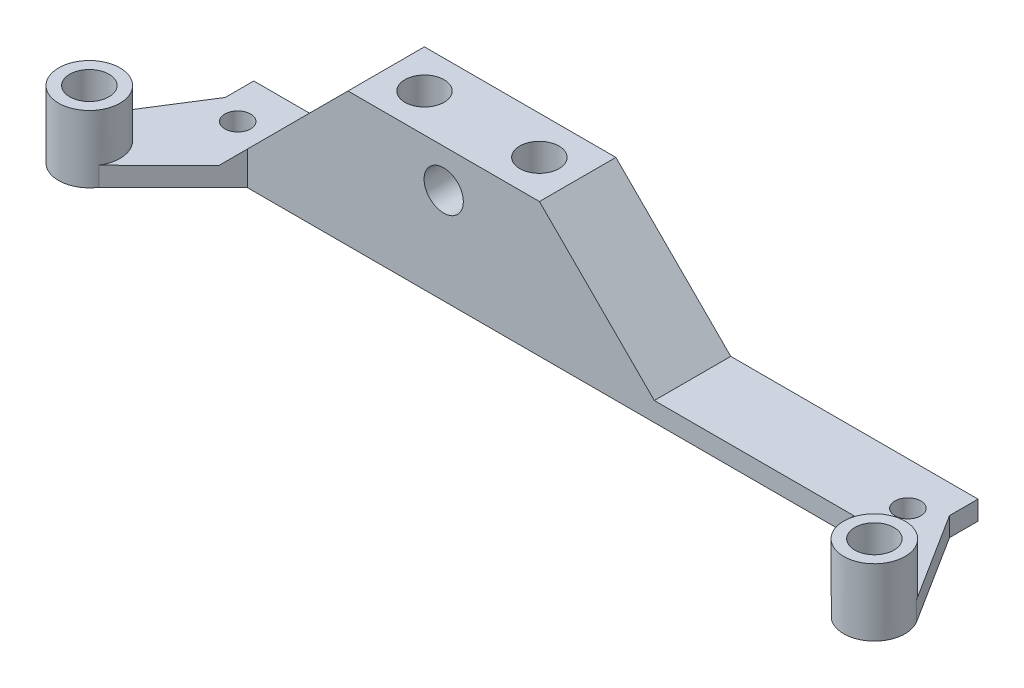
ISO-10303-21;
HEADER;
FILE_DESCRIPTION(('STEP AP214'),'2;1');
FILE_NAME('part.step','',(''),(''),'','','');
FILE_SCHEMA(('AUTOMOTIVE_DESIGN { 1 0 10303 214 1 1 1 1 }'));
ENDSEC;
DATA;
#1=APPLICATION_CONTEXT('core data for automotive mechanical design processes');
#2=APPLICATION_PROTOCOL_DEFINITION('international standard','automotive_design',2000,#1);
#3=PRODUCT_CONTEXT('',#1,'mechanical');
#4=PRODUCT('Part','Part','',(#3));
#5=PRODUCT_RELATED_PRODUCT_CATEGORY('part','',(#4));
#6=PRODUCT_DEFINITION_FORMATION('','',#4);
#7=PRODUCT_DEFINITION_CONTEXT('part definition',#1,'design');
#8=PRODUCT_DEFINITION('design','',#6,#7);
#9=PRODUCT_DEFINITION_SHAPE('','',#8);
#10=(LENGTH_UNIT() NAMED_UNIT(*) SI_UNIT(.MILLI.,.METRE.));
#11=(NAMED_UNIT(*) PLANE_ANGLE_UNIT() SI_UNIT($,.RADIAN.));
#12=(NAMED_UNIT(*) SI_UNIT($,.STERADIAN.) SOLID_ANGLE_UNIT());
#13=UNCERTAINTY_MEASURE_WITH_UNIT(LENGTH_MEASURE(1.E-05),#10,'distance_accuracy_value','');
#14=(GEOMETRIC_REPRESENTATION_CONTEXT(3) GLOBAL_UNCERTAINTY_ASSIGNED_CONTEXT((#13)) GLOBAL_UNIT_ASSIGNED_CONTEXT((#10,
#11,#12)) REPRESENTATION_CONTEXT('',''));
#15=CARTESIAN_POINT('',(0.,0.,0.));
#16=DIRECTION('',(0.,0.,1.));
#17=DIRECTION('',(1.,0.,0.));
#18=AXIS2_PLACEMENT_3D('',#15,#16,#17);
#19=CARTESIAN_POINT('',(50.2954250844381,2.,-24.539505555981));
#20=DIRECTION('',(0.,-1.,0.));
#21=DIRECTION('',(0.,0.,-1.));
#22=AXIS2_PLACEMENT_3D('',#19,#20,#21);
#23=PLANE('',#22);
#24=CARTESIAN_POINT('',(44.2954250844381,2.,-34.0395055559811));
#25=DIRECTION('',(0.,1.,0.));
#26=DIRECTION('',(0.,0.,1.));
#27=AXIS2_PLACEMENT_3D('',#24,#25,#26);
#28=CIRCLE('',#27,1.35);
#29=CARTESIAN_POINT('',(44.2954250844381,2.,-32.6895055559811));
#30=VERTEX_POINT('',#29);
#31=EDGE_CURVE('E225',#30,#30,#28,.T.);
#32=ORIENTED_EDGE('',*,*,#31,.F.);
#33=EDGE_LOOP('',(#32));
#34=FACE_BOUND('',#33,.T.);
#35=DIRECTION('',(-1.,0.,0.));
#36=VECTOR('',#35,1.);
#37=CARTESIAN_POINT('',(-28.5276596570278,2.,-38.5395055559811));
#38=LINE('',#37,#36);
#39=CARTESIAN_POINT('',(47.1182480924058,2.,-38.5395055559811));
#40=VERTEX_POINT('',#39);
#41=CARTESIAN_POINT('',(21.2954250843891,2.,-38.5395055559811));
#42=VERTEX_POINT('',#41);
#43=EDGE_CURVE('E231',#40,#42,#38,.T.);
#44=ORIENTED_EDGE('',*,*,#43,.T.);
#45=DIRECTION('',(0.,0.,1.));
#46=VECTOR('',#45,1.);
#47=CARTESIAN_POINT('',(21.2954250843891,2.,-30.5548807448663));
#48=LINE('',#47,#46);
#49=CARTESIAN_POINT('',(21.2954250843891,2.,-30.5548807448663));
#50=VERTEX_POINT('',#49);
#51=EDGE_CURVE('E150',#42,#50,#48,.T.);
#52=ORIENTED_EDGE('',*,*,#51,.T.);
#53=DIRECTION('',(1.,0.,0.));
#54=VECTOR('',#53,1.);
#55=CARTESIAN_POINT('',(-21.197718512781,2.,-30.5548807448663));
#56=LINE('',#55,#54);
#57=CARTESIAN_POINT('',(42.1517451114346,2.,-30.5548807448663));
#58=VERTEX_POINT('',#57);
#59=EDGE_CURVE('E183',#50,#58,#56,.T.);
#60=ORIENTED_EDGE('',*,*,#59,.T.);
#61=DIRECTION('',(0.,0.,1.));
#62=VECTOR('',#61,1.);
#63=CARTESIAN_POINT('',(42.1517451114346,2.,-29.1982208758625));
#64=LINE('',#63,#62);
#65=CARTESIAN_POINT('',(42.1517451114346,2.,-29.1982208758625));
#66=VERTEX_POINT('',#65);
#67=EDGE_CURVE('E240',#58,#66,#64,.T.);
#68=ORIENTED_EDGE('',*,*,#67,.T.);
#69=DIRECTION('',(0.65088317788447,0.,0.759177903226256));
#70=VECTOR('',#69,1.);
#71=CARTESIAN_POINT('',(42.1517451114346,2.,-29.1982208758625));
#72=LINE('',#71,#70);
#73=CARTESIAN_POINT('',(47.5379021217262,2.,-22.9159085893305));
#74=VERTEX_POINT('',#73);
#75=EDGE_CURVE('E242',#66,#74,#72,.T.);
#76=ORIENTED_EDGE('',*,*,#75,.T.);
#77=CARTESIAN_POINT('',(50.2954250844381,2.,-24.539505555981));
#78=DIRECTION('',(0.,1.,0.));
#79=DIRECTION('',(0.,0.,1.));
#80=AXIS2_PLACEMENT_3D('',#77,#78,#79);
#81=CIRCLE('',#80,3.20000000000002);
#82=CARTESIAN_POINT('',(53.0009895741372,2.,-26.2482831284226));
#83=VERTEX_POINT('',#82);
#84=EDGE_CURVE('E198',#83,#74,#81,.T.);
#85=ORIENTED_EDGE('',*,*,#84,.F.);
#86=DIRECTION('',(-0.53399299138798,0.,-0.845488903030973));
#87=VECTOR('',#86,1.);
#88=CARTESIAN_POINT('',(53.0009895741372,2.,-26.2482831284226));
#89=LINE('',#88,#87);
#90=CARTESIAN_POINT('',(47.1182480924058,2.,-35.5626238078308));
#91=VERTEX_POINT('',#90);
#92=EDGE_CURVE('E245',#83,#91,#89,.T.);
#93=ORIENTED_EDGE('',*,*,#92,.T.);
#94=DIRECTION('',(0.,0.,-1.));
#95=VECTOR('',#94,1.);
#96=CARTESIAN_POINT('',(47.1182480924058,2.,-38.5395055559811));
#97=LINE('',#96,#95);
#98=EDGE_CURVE('E247',#91,#40,#97,.T.);
#99=ORIENTED_EDGE('',*,*,#98,.T.);
#100=EDGE_LOOP('',(#44,#52,#60,#68,#76,#85,#93,#99));
#101=FACE_BOUND('',#100,.T.);
#102=ADVANCED_FACE('F35',(#34,#101),#23,.F.);
#103=CARTESIAN_POINT('',(-25.7045749155619,2.,-34.0395055559811));
#104=DIRECTION('',(0.,1.,0.));
#105=DIRECTION('',(0.,0.,1.));
#106=AXIS2_PLACEMENT_3D('',#103,#104,#105);
#107=CIRCLE('',#106,1.35);
#108=CARTESIAN_POINT('',(-25.7045749155619,2.,-32.6895055559811));
#109=VERTEX_POINT('',#108);
#110=EDGE_CURVE('E216',#109,#109,#107,.T.);
#111=ORIENTED_EDGE('',*,*,#110,.F.);
#112=EDGE_LOOP('',(#111));
#113=FACE_BOUND('',#112,.T.);
#114=DIRECTION('',(0.710611314616584,0.,-0.703584792003701));
#115=VECTOR('',#114,1.);
#116=CARTESIAN_POINT('',(-28.9990104258628,2.,-22.8307279835395));
#117=LINE('',#116,#115);
#118=CARTESIAN_POINT('',(-28.9990104258628,2.,-22.8307279835395));
#119=VERTEX_POINT('',#118);
#120=CARTESIAN_POINT('',(-22.7045749156108,2.,-29.0629241337666));
#121=VERTEX_POINT('',#120);
#122=EDGE_CURVE('E238',#119,#121,#117,.T.);
#123=ORIENTED_EDGE('',*,*,#122,.T.);
#124=DIRECTION('',(0.,0.,-1.));
#125=VECTOR('',#124,1.);
#126=CARTESIAN_POINT('',(-22.7045749156108,2.,-38.5395055559811));
#127=LINE('',#126,#125);
#128=CARTESIAN_POINT('',(-22.7045749156108,2.,-38.5395055559811));
#129=VERTEX_POINT('',#128);
#130=EDGE_CURVE('E155',#121,#129,#127,.T.);
#131=ORIENTED_EDGE('',*,*,#130,.T.);
#132=CARTESIAN_POINT('',(-28.5276596570278,2.,-38.5395055559811));
#133=VERTEX_POINT('',#132);
#134=EDGE_CURVE('E234',#129,#133,#38,.T.);
#135=ORIENTED_EDGE('',*,*,#134,.T.);
#136=DIRECTION('',(0.,0.,1.));
#137=VECTOR('',#136,1.);
#138=CARTESIAN_POINT('',(-28.5276596570278,2.,-38.5395055559811));
#139=LINE('',#138,#137);
#140=CARTESIAN_POINT('',(-28.5276596570278,2.,-35.5627891080539));
#141=VERTEX_POINT('',#140);
#142=EDGE_CURVE('E233',#133,#141,#139,.T.);
#143=ORIENTED_EDGE('',*,*,#142,.T.);
#144=DIRECTION('',(-0.533969233102133,0.,0.84550390779719));
#145=VECTOR('',#144,1.);
#146=CARTESIAN_POINT('',(-34.410139405261,2.,-26.2482831284225));
#147=LINE('',#146,#145);
#148=CARTESIAN_POINT('',(-34.410139405261,2.,-26.2482831284225));
#149=VERTEX_POINT('',#148);
#150=EDGE_CURVE('E236',#141,#149,#147,.T.);
#151=ORIENTED_EDGE('',*,*,#150,.T.);
#152=CARTESIAN_POINT('',(-31.7045749155619,2.,-24.539505555981));
#153=DIRECTION('',(0.,1.,0.));
#154=DIRECTION('',(0.,0.,1.));
#155=AXIS2_PLACEMENT_3D('',#152,#153,#154);
#156=CIRCLE('',#155,3.2);
#157=EDGE_CURVE('E206',#119,#149,#156,.T.);
#158=ORIENTED_EDGE('',*,*,#157,.F.);
#159=EDGE_LOOP('',(#123,#131,#135,#143,#151,#158));
#160=FACE_BOUND('',#159,.T.);
#161=ADVANCED_FACE('F309',(#113,#160),#23,.F.);
#162=CARTESIAN_POINT('',(50.2954250844381,0.,-24.539505555981));
#163=DIRECTION('',(0.,-1.,0.));
#164=DIRECTION('',(0.,0.,-1.));
#165=AXIS2_PLACEMENT_3D('',#162,#163,#164);
#166=PLANE('',#165);
#167=DIRECTION('',(0.,0.,1.));
#168=VECTOR('',#167,1.);
#169=CARTESIAN_POINT('',(-28.5276596570278,0.,-38.5395055559811));
#170=LINE('',#169,#168);
#171=CARTESIAN_POINT('',(-28.5276596570278,0.,-38.5395055559811));
#172=VERTEX_POINT('',#171);
#173=CARTESIAN_POINT('',(-28.5276596570278,0.,-35.5627891080539));
#174=VERTEX_POINT('',#173);
#175=EDGE_CURVE('E251',#172,#174,#170,.T.);
#176=ORIENTED_EDGE('',*,*,#175,.F.);
#177=DIRECTION('',(-1.,0.,0.));
#178=VECTOR('',#177,1.);
#179=CARTESIAN_POINT('',(-28.5276596570278,0.,-38.5395055559811));
#180=LINE('',#179,#178);
#181=CARTESIAN_POINT('',(47.1182480924058,0.,-38.5395055559811));
#182=VERTEX_POINT('',#181);
#183=EDGE_CURVE('E228',#182,#172,#180,.T.);
#184=ORIENTED_EDGE('',*,*,#183,.F.);
#185=DIRECTION('',(0.,0.,-1.));
#186=VECTOR('',#185,1.);
#187=CARTESIAN_POINT('',(47.1182480924058,0.,-38.5395055559811));
#188=LINE('',#187,#186);
#189=CARTESIAN_POINT('',(47.1182480924058,0.,-35.5626238078308));
#190=VERTEX_POINT('',#189);
#191=EDGE_CURVE('E267',#190,#182,#188,.T.);
#192=ORIENTED_EDGE('',*,*,#191,.F.);
#193=DIRECTION('',(-0.53399299138798,0.,-0.845488903030973));
#194=VECTOR('',#193,1.);
#195=CARTESIAN_POINT('',(53.0009895741372,0.,-26.2482831284226));
#196=LINE('',#195,#194);
#197=CARTESIAN_POINT('',(53.0009895741372,0.,-26.2482831284226));
#198=VERTEX_POINT('',#197);
#199=EDGE_CURVE('E265',#198,#190,#196,.T.);
#200=ORIENTED_EDGE('',*,*,#199,.F.);
#201=CARTESIAN_POINT('',(50.2954250844381,0.,-24.539505555981));
#202=DIRECTION('',(0.,1.,0.));
#203=DIRECTION('',(0.,0.,-1.));
#204=AXIS2_PLACEMENT_3D('',#201,#202,#203);
#205=CIRCLE('',#204,3.2);
#206=CARTESIAN_POINT('',(48.2697894922181,0.,-22.0622489185833));
#207=VERTEX_POINT('',#206);
#208=EDGE_CURVE('E263',#207,#198,#205,.T.);
#209=ORIENTED_EDGE('',*,*,#208,.F.);
#210=DIRECTION('',(0.65088317788447,0.,0.759177903226256));
#211=VECTOR('',#210,1.);
#212=CARTESIAN_POINT('',(42.1517451114346,0.,-29.1982208758625));
#213=LINE('',#212,#211);
#214=CARTESIAN_POINT('',(42.1517451114346,0.,-29.1982208758625));
#215=VERTEX_POINT('',#214);
#216=EDGE_CURVE('E261',#215,#207,#213,.T.);
#217=ORIENTED_EDGE('',*,*,#216,.F.);
#218=DIRECTION('',(0.,0.,1.));
#219=VECTOR('',#218,1.);
#220=CARTESIAN_POINT('',(42.1517451114346,0.,-29.1982208758625));
#221=LINE('',#220,#219);
#222=CARTESIAN_POINT('',(42.1517451114346,0.,-30.5548807448663));
#223=VERTEX_POINT('',#222);
#224=EDGE_CURVE('E259',#223,#215,#221,.T.);
#225=ORIENTED_EDGE('',*,*,#224,.F.);
#226=DIRECTION('',(1.,0.,0.));
#227=VECTOR('',#226,1.);
#228=CARTESIAN_POINT('',(-21.197718512781,0.,-30.5548807448663));
#229=LINE('',#228,#227);
#230=CARTESIAN_POINT('',(-21.197718512781,0.,-30.5548807448663));
#231=VERTEX_POINT('',#230);
#232=EDGE_CURVE('E185',#231,#223,#229,.T.);
#233=ORIENTED_EDGE('',*,*,#232,.F.);
#234=DIRECTION('',(0.710611314616584,0.,-0.703584792003701));
#235=VECTOR('',#234,1.);
#236=CARTESIAN_POINT('',(-28.9990104258628,0.,-22.8307279835395));
#237=LINE('',#236,#235);
#238=CARTESIAN_POINT('',(-28.9990104258628,0.,-22.8307279835395));
#239=VERTEX_POINT('',#238);
#240=EDGE_CURVE('E257',#239,#231,#237,.T.);
#241=ORIENTED_EDGE('',*,*,#240,.F.);
#242=CARTESIAN_POINT('',(-31.7045749155619,0.,-24.539505555981));
#243=DIRECTION('',(0.,1.,0.));
#244=DIRECTION('',(0.,0.,1.));
#245=AXIS2_PLACEMENT_3D('',#242,#243,#244);
#246=CIRCLE('',#245,3.2);
#247=CARTESIAN_POINT('',(-34.410139405261,0.,-26.2482831284225));
#248=VERTEX_POINT('',#247);
#249=EDGE_CURVE('E255',#248,#239,#246,.T.);
#250=ORIENTED_EDGE('',*,*,#249,.F.);
#251=DIRECTION('',(-0.533969233102133,0.,0.84550390779719));
#252=VECTOR('',#251,1.);
#253=CARTESIAN_POINT('',(-34.410139405261,0.,-26.2482831284225));
#254=LINE('',#253,#252);
#255=EDGE_CURVE('E253',#174,#248,#254,.T.);
#256=ORIENTED_EDGE('',*,*,#255,.F.);
#257=EDGE_LOOP('',(#176,#184,#192,#200,#209,#217,#225,#233,#241,#250,#256));
#258=FACE_BOUND('',#257,.T.);
#259=CARTESIAN_POINT('',(-25.7045749155619,0.,-34.0395055559811));
#260=DIRECTION('',(0.,1.,0.));
#261=DIRECTION('',(0.,0.,1.));
#262=AXIS2_PLACEMENT_3D('',#259,#260,#261);
#263=CIRCLE('',#262,1.35);
#264=CARTESIAN_POINT('',(-25.7045749155619,0.,-32.6895055559811));
#265=VERTEX_POINT('',#264);
#266=EDGE_CURVE('E215',#265,#265,#263,.T.);
#267=ORIENTED_EDGE('',*,*,#266,.T.);
#268=EDGE_LOOP('',(#267));
#269=FACE_BOUND('',#268,.T.);
#270=CARTESIAN_POINT('',(-31.7045749155619,0.,-24.539505555981));
#271=DIRECTION('',(0.,1.,0.));
#272=DIRECTION('',(0.,0.,1.));
#273=AXIS2_PLACEMENT_3D('',#270,#271,#272);
#274=CIRCLE('',#273,2.05);
#275=CARTESIAN_POINT('',(-31.7045749155619,0.,-22.489505555981));
#276=VERTEX_POINT('',#275);
#277=EDGE_CURVE('E219',#276,#276,#274,.T.);
#278=ORIENTED_EDGE('',*,*,#277,.T.);
#279=EDGE_LOOP('',(#278));
#280=FACE_BOUND('',#279,.T.);
#281=CARTESIAN_POINT('',(44.2954250844381,0.,-34.0395055559811));
#282=DIRECTION('',(0.,1.,0.));
#283=DIRECTION('',(0.,0.,1.));
#284=AXIS2_PLACEMENT_3D('',#281,#282,#283);
#285=CIRCLE('',#284,1.35);
#286=CARTESIAN_POINT('',(44.2954250844381,0.,-32.6895055559811));
#287=VERTEX_POINT('',#286);
#288=EDGE_CURVE('E224',#287,#287,#285,.T.);
#289=ORIENTED_EDGE('',*,*,#288,.T.);
#290=EDGE_LOOP('',(#289));
#291=FACE_BOUND('',#290,.T.);
#292=CARTESIAN_POINT('',(50.2954250844381,0.,-24.539505555981));
#293=DIRECTION('',(0.,1.,0.));
#294=DIRECTION('',(0.,0.,-1.));
#295=AXIS2_PLACEMENT_3D('',#292,#293,#294);
#296=CIRCLE('',#295,2.04999999999999);
#297=CARTESIAN_POINT('',(50.2954250844381,0.,-26.589505555981));
#298=VERTEX_POINT('',#297);
#299=EDGE_CURVE('E210',#298,#298,#296,.T.);
#300=ORIENTED_EDGE('',*,*,#299,.T.);
#301=EDGE_LOOP('',(#300));
#302=FACE_BOUND('',#301,.T.);
#303=ADVANCED_FACE('F330',(#258,#269,#280,#291,#302),#166,.T.);
#304=CARTESIAN_POINT('',(-28.5276596570278,2.,-38.5395055559811));
#305=DIRECTION('',(0.,0.,1.));
#306=DIRECTION('',(1.,0.,0.));
#307=AXIS2_PLACEMENT_3D('',#304,#305,#306);
#308=PLANE('',#307);
#309=CARTESIAN_POINT('',(-0.704574915610868,10.,-38.5395055559811));
#310=DIRECTION('',(0.,0.,-1.));
#311=DIRECTION('',(-1.,0.,0.));
#312=AXIS2_PLACEMENT_3D('',#309,#310,#311);
#313=CIRCLE('',#312,2.05);
#314=CARTESIAN_POINT('',(-2.75457491561087,10.,-38.5395055559811));
#315=VERTEX_POINT('',#314);
#316=EDGE_CURVE('E299',#315,#315,#313,.T.);
#317=ORIENTED_EDGE('',*,*,#316,.F.);
#318=EDGE_LOOP('',(#317));
#319=FACE_BOUND('',#318,.T.);
#320=DIRECTION('',(0.,-1.,0.));
#321=VECTOR('',#320,1.);
#322=CARTESIAN_POINT('',(-28.5276596570278,2.,-38.5395055559811));
#323=LINE('',#322,#321);
#324=EDGE_CURVE('E293',#133,#172,#323,.T.);
#325=ORIENTED_EDGE('',*,*,#324,.F.);
#326=ORIENTED_EDGE('',*,*,#134,.F.);
#327=DIRECTION('',(-0.707106781186546,-0.707106781186549,0.));
#328=VECTOR('',#327,1.);
#329=CARTESIAN_POINT('',(-25.6161172863193,-0.91154237070848,-38.5395055559811));
#330=LINE('',#329,#328);
#331=CARTESIAN_POINT('',(-10.7045749156109,14.,-38.5395055559811));
#332=VERTEX_POINT('',#331);
#333=EDGE_CURVE('E11',#129,#332,#330,.F.);
#334=ORIENTED_EDGE('',*,*,#333,.T.);
#335=DIRECTION('',(-1.,0.,0.));
#336=VECTOR('',#335,1.);
#337=CARTESIAN_POINT('',(9.29542508438913,14.,-38.5395055559811));
#338=LINE('',#337,#336);
#339=CARTESIAN_POINT('',(9.29542508438913,14.,-38.5395055559811));
#340=VERTEX_POINT('',#339);
#341=EDGE_CURVE('E158',#340,#332,#338,.T.);
#342=ORIENTED_EDGE('',*,*,#341,.F.);
#343=DIRECTION('',(-0.707106781186546,0.707106781186549,0.));
#344=VECTOR('',#343,1.);
#345=CARTESIAN_POINT('',(-3.61611728631925,26.9115423707084,-38.5395055559811));
#346=LINE('',#345,#344);
#347=EDGE_CURVE('E144',#340,#42,#346,.F.);
#348=ORIENTED_EDGE('',*,*,#347,.T.);
#349=ORIENTED_EDGE('',*,*,#43,.F.);
#350=DIRECTION('',(0.,-1.,0.));
#351=VECTOR('',#350,1.);
#352=CARTESIAN_POINT('',(47.1182480924058,2.,-38.5395055559811));
#353=LINE('',#352,#351);
#354=EDGE_CURVE('E249',#40,#182,#353,.T.);
#355=ORIENTED_EDGE('',*,*,#354,.T.);
#356=ORIENTED_EDGE('',*,*,#183,.T.);
#357=EDGE_LOOP('',(#325,#326,#334,#342,#348,#349,#355,#356));
#358=FACE_BOUND('',#357,.T.);
#359=ADVANCED_FACE('F160',(#319,#358),#308,.F.);
#360=CARTESIAN_POINT('',(-28.5276596570278,2.,-38.5395055559811));
#361=DIRECTION('',(1.,0.,0.));
#362=DIRECTION('',(0.,0.,-1.));
#363=AXIS2_PLACEMENT_3D('',#360,#361,#362);
#364=PLANE('',#363);
#365=ORIENTED_EDGE('',*,*,#175,.T.);
#366=DIRECTION('',(0.,-1.,0.));
#367=VECTOR('',#366,1.);
#368=CARTESIAN_POINT('',(-28.5276596570278,2.,-35.5627891080539));
#369=LINE('',#368,#367);
#370=EDGE_CURVE('E290',#141,#174,#369,.T.);
#371=ORIENTED_EDGE('',*,*,#370,.F.);
#372=ORIENTED_EDGE('',*,*,#142,.F.);
#373=ORIENTED_EDGE('',*,*,#324,.T.);
#374=EDGE_LOOP('',(#365,#371,#372,#373));
#375=FACE_BOUND('',#374,.T.);
#376=ADVANCED_FACE('F315',(#375),#364,.F.);
#377=CARTESIAN_POINT('',(-34.410139405261,2.,-26.2482831284225));
#378=DIRECTION('',(0.84550390779719,0.,0.533969233102133));
#379=DIRECTION('',(0.533969233102133,0.,-0.84550390779719));
#380=AXIS2_PLACEMENT_3D('',#377,#378,#379);
#381=PLANE('',#380);
#382=ORIENTED_EDGE('',*,*,#255,.T.);
#383=DIRECTION('',(0.,-1.,0.));
#384=VECTOR('',#383,1.);
#385=CARTESIAN_POINT('',(-34.410139405261,2.,-26.2482831284225));
#386=LINE('',#385,#384);
#387=EDGE_CURVE('E287',#149,#248,#386,.T.);
#388=ORIENTED_EDGE('',*,*,#387,.F.);
#389=ORIENTED_EDGE('',*,*,#150,.F.);
#390=ORIENTED_EDGE('',*,*,#370,.T.);
#391=EDGE_LOOP('',(#382,#388,#389,#390));
#392=FACE_BOUND('',#391,.T.);
#393=ADVANCED_FACE('F320',(#392),#381,.F.);
#394=CARTESIAN_POINT('',(-31.7045749155619,2.,-24.539505555981));
#395=DIRECTION('',(0.,-1.,0.));
#396=DIRECTION('',(0.,0.,-1.));
#397=AXIS2_PLACEMENT_3D('',#394,#395,#396);
#398=CYLINDRICAL_SURFACE('',#397,3.2);
#399=ORIENTED_EDGE('',*,*,#249,.T.);
#400=DIRECTION('',(0.,-1.,0.));
#401=VECTOR('',#400,1.);
#402=CARTESIAN_POINT('',(-28.9990104258628,2.,-22.8307279835395));
#403=LINE('',#402,#401);
#404=EDGE_CURVE('E284',#119,#239,#403,.T.);
#405=ORIENTED_EDGE('',*,*,#404,.F.);
#406=ORIENTED_EDGE('',*,*,#157,.T.);
#407=ORIENTED_EDGE('',*,*,#387,.T.);
#408=EDGE_LOOP('',(#399,#405,#406,#407));
#409=FACE_BOUND('',#408,.T.);
#410=CARTESIAN_POINT('',(-31.7045749155619,7.,-24.539505555981));
#411=DIRECTION('',(0.,1.,0.));
#412=DIRECTION('',(0.,0.,1.));
#413=AXIS2_PLACEMENT_3D('',#410,#411,#412);
#414=CIRCLE('',#413,3.2);
#415=CARTESIAN_POINT('',(-31.7045749155619,7.,-21.339505555981));
#416=VERTEX_POINT('',#415);
#417=EDGE_CURVE('E207',#416,#416,#414,.T.);
#418=ORIENTED_EDGE('',*,*,#417,.F.);
#419=EDGE_LOOP('',(#418));
#420=FACE_BOUND('',#419,.T.);
#421=ADVANCED_FACE('F325',(#409,#420),#398,.T.);
#422=CARTESIAN_POINT('',(-28.9990104258628,2.,-22.8307279835395));
#423=DIRECTION('',(-0.703584792003701,0.,-0.710611314616584));
#424=DIRECTION('',(-0.710611314616584,0.,0.703584792003701));
#425=AXIS2_PLACEMENT_3D('',#422,#423,#424);
#426=PLANE('',#425);
#427=ORIENTED_EDGE('',*,*,#240,.T.);
#428=DIRECTION('',(0.,-1.,0.));
#429=VECTOR('',#428,1.);
#430=CARTESIAN_POINT('',(-21.197718512781,2.,-30.5548807448663));
#431=LINE('',#430,#429);
#432=CARTESIAN_POINT('',(-21.197718512781,3.50685640282978,-30.5548807448663));
#433=VERTEX_POINT('',#432);
#434=EDGE_CURVE('E51',#433,#231,#431,.T.);
#435=ORIENTED_EDGE('',*,*,#434,.F.);
#436=DIRECTION('',(0.579253173532803,0.579253173532805,-0.573525519837043));
#437=VECTOR('',#436,1.);
#438=CARTESIAN_POINT('',(-26.8870117966948,-2.18243688108396,-24.9218431764027));
#439=LINE('',#438,#437);
#440=EDGE_CURVE('E44',#433,#121,#439,.F.);
#441=ORIENTED_EDGE('',*,*,#440,.T.);
#442=ORIENTED_EDGE('',*,*,#122,.F.);
#443=ORIENTED_EDGE('',*,*,#404,.T.);
#444=EDGE_LOOP('',(#427,#435,#441,#442,#443));
#445=FACE_BOUND('',#444,.T.);
#446=ADVANCED_FACE('F328',(#445),#426,.F.);
#447=CARTESIAN_POINT('',(42.1517451114346,2.,-29.1982208758625));
#448=DIRECTION('',(1.,0.,0.));
#449=DIRECTION('',(0.,0.,-1.));
#450=AXIS2_PLACEMENT_3D('',#447,#448,#449);
#451=PLANE('',#450);
#452=ORIENTED_EDGE('',*,*,#67,.F.);
#453=DIRECTION('',(0.,1.,0.));
#454=VECTOR('',#453,1.);
#455=CARTESIAN_POINT('',(42.1517451114346,-63.850675602143,-30.5548807448663));
#456=LINE('',#455,#454);
#457=EDGE_CURVE('E187',#223,#58,#456,.T.);
#458=ORIENTED_EDGE('',*,*,#457,.F.);
#459=ORIENTED_EDGE('',*,*,#224,.T.);
#460=DIRECTION('',(0.,-1.,0.));
#461=VECTOR('',#460,1.);
#462=CARTESIAN_POINT('',(42.1517451114346,2.,-29.1982208758625));
#463=LINE('',#462,#461);
#464=EDGE_CURVE('E280',#66,#215,#463,.T.);
#465=ORIENTED_EDGE('',*,*,#464,.F.);
#466=EDGE_LOOP('',(#452,#458,#459,#465));
#467=FACE_BOUND('',#466,.T.);
#468=ADVANCED_FACE('F338',(#467),#451,.F.);
#469=CARTESIAN_POINT('',(42.1517451114346,2.,-29.1982208758625));
#470=DIRECTION('',(0.759177903226255,0.,-0.65088317788447));
#471=DIRECTION('',(-0.65088317788447,0.,-0.759177903226256));
#472=AXIS2_PLACEMENT_3D('',#469,#470,#471);
#473=PLANE('',#472);
#474=ORIENTED_EDGE('',*,*,#216,.T.);
#475=DIRECTION('',(0.,-1.,0.));
#476=VECTOR('',#475,1.);
#477=CARTESIAN_POINT('',(48.2697894922181,2.,-22.0622489185833));
#478=LINE('',#477,#476);
#479=CARTESIAN_POINT('',(48.2697894922181,2.,-22.0622489185833));
#480=VERTEX_POINT('',#479);
#481=EDGE_CURVE('E277',#480,#207,#478,.T.);
#482=ORIENTED_EDGE('',*,*,#481,.F.);
#483=DIRECTION('',(0.65088317788447,0.,0.759177903226256));
#484=VECTOR('',#483,1.);
#485=CARTESIAN_POINT('',(42.1517451114346,2.,-29.1982208758625));
#486=LINE('',#485,#484);
#487=EDGE_CURVE('E197',#74,#480,#486,.T.);
#488=ORIENTED_EDGE('',*,*,#487,.F.);
#489=ORIENTED_EDGE('',*,*,#75,.F.);
#490=ORIENTED_EDGE('',*,*,#464,.T.);
#491=EDGE_LOOP('',(#474,#482,#488,#489,#490));
#492=FACE_BOUND('',#491,.T.);
#493=ADVANCED_FACE('F360',(#492),#473,.F.);
#494=CARTESIAN_POINT('',(50.2954250844381,2.,-24.539505555981));
#495=DIRECTION('',(0.,-1.,0.));
#496=DIRECTION('',(0.,0.,-1.));
#497=AXIS2_PLACEMENT_3D('',#494,#495,#496);
#498=CYLINDRICAL_SURFACE('',#497,3.2);
#499=ORIENTED_EDGE('',*,*,#208,.T.);
#500=DIRECTION('',(0.,-1.,0.));
#501=VECTOR('',#500,1.);
#502=CARTESIAN_POINT('',(53.0009895741372,2.,-26.2482831284226));
#503=LINE('',#502,#501);
#504=EDGE_CURVE('E274',#83,#198,#503,.T.);
#505=ORIENTED_EDGE('',*,*,#504,.F.);
#506=ORIENTED_EDGE('',*,*,#84,.T.);
#507=EDGE_CURVE('E193',#74,#480,#81,.T.);
#508=ORIENTED_EDGE('',*,*,#507,.T.);
#509=ORIENTED_EDGE('',*,*,#481,.T.);
#510=EDGE_LOOP('',(#499,#505,#506,#508,#509));
#511=FACE_BOUND('',#510,.T.);
#512=CARTESIAN_POINT('',(50.2954250844381,7.,-24.539505555981));
#513=DIRECTION('',(0.,1.,0.));
#514=DIRECTION('',(0.,0.,1.));
#515=AXIS2_PLACEMENT_3D('',#512,#513,#514);
#516=CIRCLE('',#515,3.20000000000002);
#517=CARTESIAN_POINT('',(50.2954250844381,7.,-21.339505555981));
#518=VERTEX_POINT('',#517);
#519=EDGE_CURVE('E194',#518,#518,#516,.T.);
#520=ORIENTED_EDGE('',*,*,#519,.F.);
#521=EDGE_LOOP('',(#520));
#522=FACE_BOUND('',#521,.T.);
#523=ADVANCED_FACE('F356',(#511,#522),#498,.T.);
#524=CARTESIAN_POINT('',(53.0009895741372,2.,-26.2482831284226));
#525=DIRECTION('',(-0.845488903030973,0.,0.533992991387979));
#526=DIRECTION('',(0.533992991387979,0.,0.845488903030973));
#527=AXIS2_PLACEMENT_3D('',#524,#525,#526);
#528=PLANE('',#527);
#529=ORIENTED_EDGE('',*,*,#199,.T.);
#530=DIRECTION('',(0.,-1.,0.));
#531=VECTOR('',#530,1.);
#532=CARTESIAN_POINT('',(47.1182480924058,2.,-35.5626238078308));
#533=LINE('',#532,#531);
#534=EDGE_CURVE('E271',#91,#190,#533,.T.);
#535=ORIENTED_EDGE('',*,*,#534,.F.);
#536=ORIENTED_EDGE('',*,*,#92,.F.);
#537=ORIENTED_EDGE('',*,*,#504,.T.);
#538=EDGE_LOOP('',(#529,#535,#536,#537));
#539=FACE_BOUND('',#538,.T.);
#540=ADVANCED_FACE('F353',(#539),#528,.F.);
#541=CARTESIAN_POINT('',(47.1182480924058,2.,-38.5395055559811));
#542=DIRECTION('',(-1.,0.,0.));
#543=DIRECTION('',(0.,0.,1.));
#544=AXIS2_PLACEMENT_3D('',#541,#542,#543);
#545=PLANE('',#544);
#546=ORIENTED_EDGE('',*,*,#191,.T.);
#547=ORIENTED_EDGE('',*,*,#354,.F.);
#548=ORIENTED_EDGE('',*,*,#98,.F.);
#549=ORIENTED_EDGE('',*,*,#534,.T.);
#550=EDGE_LOOP('',(#546,#547,#548,#549));
#551=FACE_BOUND('',#550,.T.);
#552=ADVANCED_FACE('F350',(#551),#545,.F.);
#553=CARTESIAN_POINT('',(44.2954250844381,2.,-34.0395055559811));
#554=DIRECTION('',(0.,-1.,0.));
#555=DIRECTION('',(0.,0.,-1.));
#556=AXIS2_PLACEMENT_3D('',#553,#554,#555);
#557=CYLINDRICAL_SURFACE('',#556,1.35);
#558=ORIENTED_EDGE('',*,*,#31,.T.);
#559=EDGE_LOOP('',(#558));
#560=FACE_BOUND('',#559,.T.);
#561=ORIENTED_EDGE('',*,*,#288,.F.);
#562=EDGE_LOOP('',(#561));
#563=FACE_BOUND('',#562,.T.);
#564=ADVANCED_FACE('F386',(#560,#563),#557,.F.);
#565=CARTESIAN_POINT('',(-31.7045749155619,2.,-24.539505555981));
#566=DIRECTION('',(0.,-1.,0.));
#567=DIRECTION('',(0.,0.,-1.));
#568=AXIS2_PLACEMENT_3D('',#565,#566,#567);
#569=CYLINDRICAL_SURFACE('',#568,2.05);
#570=ORIENTED_EDGE('',*,*,#277,.F.);
#571=EDGE_LOOP('',(#570));
#572=FACE_BOUND('',#571,.T.);
#573=CARTESIAN_POINT('',(-31.7045749155619,7.,-24.539505555981));
#574=DIRECTION('',(0.,1.,0.));
#575=DIRECTION('',(0.,0.,1.));
#576=AXIS2_PLACEMENT_3D('',#573,#574,#575);
#577=CIRCLE('',#576,2.05);
#578=CARTESIAN_POINT('',(-31.7045749155619,7.,-22.489505555981));
#579=VERTEX_POINT('',#578);
#580=EDGE_CURVE('E203',#579,#579,#577,.T.);
#581=ORIENTED_EDGE('',*,*,#580,.T.);
#582=EDGE_LOOP('',(#581));
#583=FACE_BOUND('',#582,.T.);
#584=ADVANCED_FACE('F536',(#572,#583),#569,.F.);
#585=CARTESIAN_POINT('',(-25.7045749155619,2.,-34.0395055559811));
#586=DIRECTION('',(0.,-1.,0.));
#587=DIRECTION('',(0.,0.,-1.));
#588=AXIS2_PLACEMENT_3D('',#585,#586,#587);
#589=CYLINDRICAL_SURFACE('',#588,1.35);
#590=ORIENTED_EDGE('',*,*,#110,.T.);
#591=EDGE_LOOP('',(#590));
#592=FACE_BOUND('',#591,.T.);
#593=ORIENTED_EDGE('',*,*,#266,.F.);
#594=EDGE_LOOP('',(#593));
#595=FACE_BOUND('',#594,.T.);
#596=ADVANCED_FACE('F543',(#592,#595),#589,.F.);
#597=CARTESIAN_POINT('',(50.2954250844381,2.,-24.539505555981));
#598=DIRECTION('',(0.,-1.,0.));
#599=DIRECTION('',(0.,0.,-1.));
#600=AXIS2_PLACEMENT_3D('',#597,#598,#599);
#601=CYLINDRICAL_SURFACE('',#600,2.04999999999999);
#602=ORIENTED_EDGE('',*,*,#299,.F.);
#603=EDGE_LOOP('',(#602));
#604=FACE_BOUND('',#603,.T.);
#605=CARTESIAN_POINT('',(50.2954250844381,7.,-24.539505555981));
#606=DIRECTION('',(0.,1.,0.));
#607=DIRECTION('',(0.,0.,1.));
#608=AXIS2_PLACEMENT_3D('',#605,#606,#607);
#609=CIRCLE('',#608,2.04999999999999);
#610=CARTESIAN_POINT('',(50.2954250844381,7.,-22.489505555981));
#611=VERTEX_POINT('',#610);
#612=EDGE_CURVE('E190',#611,#611,#609,.T.);
#613=ORIENTED_EDGE('',*,*,#612,.T.);
#614=EDGE_LOOP('',(#613));
#615=FACE_BOUND('',#614,.T.);
#616=ADVANCED_FACE('F373',(#604,#615),#601,.F.);
#617=CARTESIAN_POINT('',(-31.7045749155619,7.,-24.539505555981));
#618=DIRECTION('',(0.,1.,0.));
#619=DIRECTION('',(0.,0.,1.));
#620=AXIS2_PLACEMENT_3D('',#617,#618,#619);
#621=PLANE('',#620);
#622=ORIENTED_EDGE('',*,*,#417,.T.);
#623=EDGE_LOOP('',(#622));
#624=FACE_BOUND('',#623,.T.);
#625=ORIENTED_EDGE('',*,*,#580,.F.);
#626=EDGE_LOOP('',(#625));
#627=FACE_BOUND('',#626,.T.);
#628=ADVANCED_FACE('F365',(#624,#627),#621,.T.);
#629=CARTESIAN_POINT('',(50.2954250844381,2.,-24.539505555981));
#630=DIRECTION('',(0.,1.,0.));
#631=DIRECTION('',(0.,0.,1.));
#632=AXIS2_PLACEMENT_3D('',#629,#630,#631);
#633=PLANE('',#632);
#634=ORIENTED_EDGE('',*,*,#507,.F.);
#635=ORIENTED_EDGE('',*,*,#487,.T.);
#636=EDGE_LOOP('',(#634,#635));
#637=FACE_BOUND('',#636,.T.);
#638=ADVANCED_FACE('F362',(#637),#633,.F.);
#639=CARTESIAN_POINT('',(50.2954250844381,7.,-24.539505555981));
#640=DIRECTION('',(0.,1.,0.));
#641=DIRECTION('',(0.,0.,1.));
#642=AXIS2_PLACEMENT_3D('',#639,#640,#641);
#643=PLANE('',#642);
#644=ORIENTED_EDGE('',*,*,#519,.T.);
#645=EDGE_LOOP('',(#644));
#646=FACE_BOUND('',#645,.T.);
#647=ORIENTED_EDGE('',*,*,#612,.F.);
#648=EDGE_LOOP('',(#647));
#649=FACE_BOUND('',#648,.T.);
#650=ADVANCED_FACE('F364',(#646,#649),#643,.T.);
#651=CARTESIAN_POINT('',(-21.197718512781,-63.850675602143,-30.5548807448663));
#652=DIRECTION('',(0.,0.,1.));
#653=DIRECTION('',(1.,0.,0.));
#654=AXIS2_PLACEMENT_3D('',#651,#652,#653);
#655=PLANE('',#654);
#656=CARTESIAN_POINT('',(-0.704574915610868,10.,-30.5548807448663));
#657=DIRECTION('',(0.,0.,1.));
#658=DIRECTION('',(1.,0.,0.));
#659=AXIS2_PLACEMENT_3D('',#656,#657,#658);
#660=CIRCLE('',#659,2.05);
#661=CARTESIAN_POINT('',(1.34542508438913,10.,-30.5548807448663));
#662=VERTEX_POINT('',#661);
#663=EDGE_CURVE('E296',#662,#662,#660,.T.);
#664=ORIENTED_EDGE('',*,*,#663,.F.);
#665=EDGE_LOOP('',(#664));
#666=FACE_BOUND('',#665,.T.);
#667=ORIENTED_EDGE('',*,*,#434,.T.);
#668=ORIENTED_EDGE('',*,*,#232,.T.);
#669=ORIENTED_EDGE('',*,*,#457,.T.);
#670=ORIENTED_EDGE('',*,*,#59,.F.);
#671=DIRECTION('',(0.707106781186546,-0.707106781186549,0.));
#672=VECTOR('',#671,1.);
#673=CARTESIAN_POINT('',(9.29542508438913,14.,-30.5548807448663));
#674=LINE('',#673,#672);
#675=CARTESIAN_POINT('',(9.29542508438914,14.,-30.5548807448663));
#676=VERTEX_POINT('',#675);
#677=EDGE_CURVE('E154',#50,#676,#674,.F.);
#678=ORIENTED_EDGE('',*,*,#677,.T.);
#679=DIRECTION('',(1.,0.,0.));
#680=VECTOR('',#679,1.);
#681=CARTESIAN_POINT('',(9.29542508438914,14.,-30.5548807448663));
#682=LINE('',#681,#680);
#683=CARTESIAN_POINT('',(-10.7045749156109,14.,-30.5548807448663));
#684=VERTEX_POINT('',#683);
#685=EDGE_CURVE('E171',#684,#676,#682,.T.);
#686=ORIENTED_EDGE('',*,*,#685,.F.);
#687=DIRECTION('',(0.707106781186546,0.707106781186549,0.));
#688=VECTOR('',#687,1.);
#689=CARTESIAN_POINT('',(-10.7045749156109,14.,-30.5548807448663));
#690=LINE('',#689,#688);
#691=EDGE_CURVE('E303',#684,#433,#690,.F.);
#692=ORIENTED_EDGE('',*,*,#691,.T.);
#693=EDGE_LOOP('',(#667,#668,#669,#670,#678,#686,#692));
#694=FACE_BOUND('',#693,.T.);
#695=ADVANCED_FACE('F305',(#666,#694),#655,.T.);
#696=CARTESIAN_POINT('',(0.,14.,0.));
#697=DIRECTION('',(0.,-1.,0.));
#698=DIRECTION('',(0.,0.,-1.));
#699=AXIS2_PLACEMENT_3D('',#696,#697,#698);
#700=PLANE('',#699);
#701=CARTESIAN_POINT('',(-6.70457491556188,14.,-34.5471931504164));
#702=DIRECTION('',(0.,1.,0.));
#703=DIRECTION('',(0.,0.,1.));
#704=AXIS2_PLACEMENT_3D('',#701,#702,#703);
#705=CIRCLE('',#704,2.05000000000001);
#706=CARTESIAN_POINT('',(-6.70457491556188,14.,-32.4971931504164));
#707=VERTEX_POINT('',#706);
#708=EDGE_CURVE('E175',#707,#707,#705,.T.);
#709=ORIENTED_EDGE('',*,*,#708,.F.);
#710=EDGE_LOOP('',(#709));
#711=FACE_BOUND('',#710,.T.);
#712=CARTESIAN_POINT('',(5.29542508443812,14.,-34.5471931504164));
#713=DIRECTION('',(0.,1.,0.));
#714=DIRECTION('',(0.,0.,1.));
#715=AXIS2_PLACEMENT_3D('',#712,#713,#714);
#716=CIRCLE('',#715,2.05000000000001);
#717=CARTESIAN_POINT('',(5.29542508443812,14.,-32.4971931504164));
#718=VERTEX_POINT('',#717);
#719=EDGE_CURVE('E178',#718,#718,#716,.T.);
#720=ORIENTED_EDGE('',*,*,#719,.F.);
#721=EDGE_LOOP('',(#720));
#722=FACE_BOUND('',#721,.T.);
#723=DIRECTION('',(0.,0.,-1.));
#724=VECTOR('',#723,1.);
#725=CARTESIAN_POINT('',(9.29542508438913,14.,-38.5395055559811));
#726=LINE('',#725,#724);
#727=EDGE_CURVE('E149',#676,#340,#726,.T.);
#728=ORIENTED_EDGE('',*,*,#727,.T.);
#729=ORIENTED_EDGE('',*,*,#341,.T.);
#730=DIRECTION('',(0.,0.,1.));
#731=VECTOR('',#730,1.);
#732=CARTESIAN_POINT('',(-10.7045749156109,14.,-38.5395055559811));
#733=LINE('',#732,#731);
#734=EDGE_CURVE('E166',#332,#684,#733,.T.);
#735=ORIENTED_EDGE('',*,*,#734,.T.);
#736=ORIENTED_EDGE('',*,*,#685,.T.);
#737=EDGE_LOOP('',(#728,#729,#735,#736));
#738=FACE_BOUND('',#737,.T.);
#739=ADVANCED_FACE('F169',(#711,#722,#738),#700,.F.);
#740=CARTESIAN_POINT('',(5.29542508443812,6.,-34.5471931504164));
#741=DIRECTION('',(0.,1.,0.));
#742=DIRECTION('',(0.,0.,1.));
#743=AXIS2_PLACEMENT_3D('',#740,#741,#742);
#744=CYLINDRICAL_SURFACE('',#743,2.05000000000001);
#745=CARTESIAN_POINT('',(5.29542508443812,6.,-34.5471931504164));
#746=DIRECTION('',(0.,1.,0.));
#747=DIRECTION('',(0.,0.,1.));
#748=AXIS2_PLACEMENT_3D('',#745,#746,#747);
#749=CIRCLE('',#748,2.05000000000001);
#750=CARTESIAN_POINT('',(5.29542508443812,6.,-32.4971931504164));
#751=VERTEX_POINT('',#750);
#752=EDGE_CURVE('E692',#751,#751,#749,.T.);
#753=ORIENTED_EDGE('',*,*,#752,.F.);
#754=EDGE_LOOP('',(#753));
#755=FACE_BOUND('',#754,.T.);
#756=ORIENTED_EDGE('',*,*,#719,.T.);
#757=EDGE_LOOP('',(#756));
#758=FACE_BOUND('',#757,.T.);
#759=ADVANCED_FACE('F436',(#755,#758),#744,.F.);
#760=CARTESIAN_POINT('',(5.29542508443812,6.,-34.5471931504164));
#761=DIRECTION('',(0.,1.,0.));
#762=DIRECTION('',(0.,0.,1.));
#763=AXIS2_PLACEMENT_3D('',#760,#761,#762);
#764=PLANE('',#763);
#765=ORIENTED_EDGE('',*,*,#752,.T.);
#766=EDGE_LOOP('',(#765));
#767=FACE_BOUND('',#766,.T.);
#768=ADVANCED_FACE('F432',(#767),#764,.T.);
#769=CARTESIAN_POINT('',(-6.70457491556188,6.,-34.5471931504164));
#770=DIRECTION('',(0.,1.,0.));
#771=DIRECTION('',(0.,0.,1.));
#772=AXIS2_PLACEMENT_3D('',#769,#770,#771);
#773=CYLINDRICAL_SURFACE('',#772,2.05000000000001);
#774=CARTESIAN_POINT('',(-6.70457491556188,6.,-34.5471931504164));
#775=DIRECTION('',(0.,1.,0.));
#776=DIRECTION('',(0.,0.,1.));
#777=AXIS2_PLACEMENT_3D('',#774,#775,#776);
#778=CIRCLE('',#777,2.05000000000001);
#779=CARTESIAN_POINT('',(-6.70457491556188,6.,-32.4971931504164));
#780=VERTEX_POINT('',#779);
#781=EDGE_CURVE('E172',#780,#780,#778,.T.);
#782=ORIENTED_EDGE('',*,*,#781,.F.);
#783=EDGE_LOOP('',(#782));
#784=FACE_BOUND('',#783,.T.);
#785=ORIENTED_EDGE('',*,*,#708,.T.);
#786=EDGE_LOOP('',(#785));
#787=FACE_BOUND('',#786,.T.);
#788=ADVANCED_FACE('F425',(#784,#787),#773,.F.);
#789=CARTESIAN_POINT('',(-6.70457491556188,6.,-34.5471931504164));
#790=DIRECTION('',(0.,1.,0.));
#791=DIRECTION('',(0.,0.,1.));
#792=AXIS2_PLACEMENT_3D('',#789,#790,#791);
#793=PLANE('',#792);
#794=ORIENTED_EDGE('',*,*,#781,.T.);
#795=EDGE_LOOP('',(#794));
#796=FACE_BOUND('',#795,.T.);
#797=ADVANCED_FACE('F419',(#796),#793,.T.);
#798=CARTESIAN_POINT('',(-0.704574915610868,10.,-21.339505555981));
#799=DIRECTION('',(0.,0.,-1.));
#800=DIRECTION('',(-1.,0.,0.));
#801=AXIS2_PLACEMENT_3D('',#798,#799,#800);
#802=CYLINDRICAL_SURFACE('',#801,2.05);
#803=ORIENTED_EDGE('',*,*,#663,.T.);
#804=EDGE_LOOP('',(#803));
#805=FACE_BOUND('',#804,.T.);
#806=ORIENTED_EDGE('',*,*,#316,.T.);
#807=EDGE_LOOP('',(#806));
#808=FACE_BOUND('',#807,.T.);
#809=ADVANCED_FACE('F414',(#805,#808),#802,.F.);
#810=CARTESIAN_POINT('',(9.29542508438913,14.,-38.5395055559811));
#811=DIRECTION('',(0.707106781186549,0.707106781186546,0.));
#812=DIRECTION('',(0.,0.,1.));
#813=AXIS2_PLACEMENT_3D('',#810,#811,#812);
#814=PLANE('',#813);
#815=ORIENTED_EDGE('',*,*,#677,.F.);
#816=ORIENTED_EDGE('',*,*,#51,.F.);
#817=ORIENTED_EDGE('',*,*,#347,.F.);
#818=ORIENTED_EDGE('',*,*,#727,.F.);
#819=EDGE_LOOP('',(#815,#816,#817,#818));
#820=FACE_BOUND('',#819,.T.);
#821=ADVANCED_FACE('F147',(#820),#814,.T.);
#822=CARTESIAN_POINT('',(-10.7045749156109,14.,-38.5395055559811));
#823=DIRECTION('',(-0.707106781186549,0.707106781186546,0.));
#824=DIRECTION('',(0.,0.,-1.));
#825=AXIS2_PLACEMENT_3D('',#822,#823,#824);
#826=PLANE('',#825);
#827=ORIENTED_EDGE('',*,*,#333,.F.);
#828=ORIENTED_EDGE('',*,*,#130,.F.);
#829=ORIENTED_EDGE('',*,*,#440,.F.);
#830=ORIENTED_EDGE('',*,*,#691,.F.);
#831=ORIENTED_EDGE('',*,*,#734,.F.);
#832=EDGE_LOOP('',(#827,#828,#829,#830,#831));
#833=FACE_BOUND('',#832,.T.);
#834=ADVANCED_FACE('F38',(#833),#826,.T.);
#835=CLOSED_SHELL('',(#102,#161,#303,#359,#376,#393,#421,#446,#468,#493,#523,#540,#552,#564,
#584,#596,#616,#628,#638,#650,#695,#739,#759,#768,#788,#797,#809,#821,#834));
#836=MANIFOLD_SOLID_BREP('B2',#835);
#837=ADVANCED_BREP_SHAPE_REPRESENTATION('',(#18,#836),#14);
#838=SHAPE_DEFINITION_REPRESENTATION(#9,#837);
ENDSEC;
END-ISO-10303-21;
